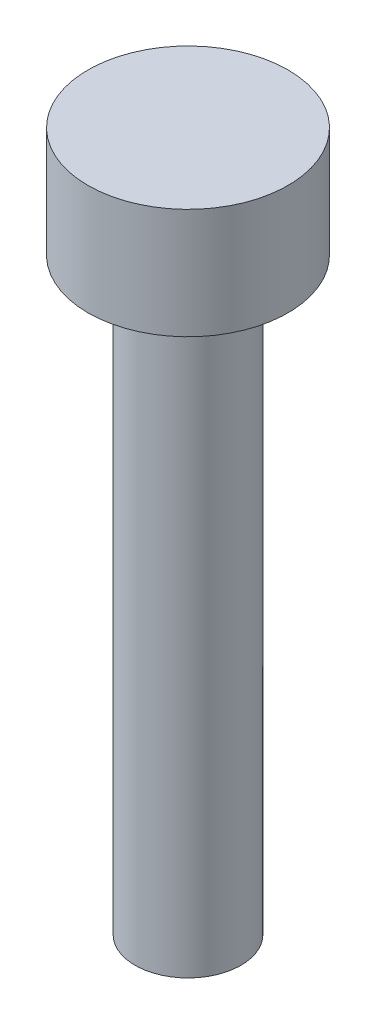
ISO-10303-21;
HEADER;
FILE_DESCRIPTION(('STEP AP214'),'2;1');
FILE_NAME('part.step','',(''),(''),'','','');
FILE_SCHEMA(('AUTOMOTIVE_DESIGN { 1 0 10303 214 1 1 1 1 }'));
ENDSEC;
DATA;
#1=APPLICATION_CONTEXT('core data for automotive mechanical design processes');
#2=APPLICATION_PROTOCOL_DEFINITION('international standard','automotive_design',2000,#1);
#3=PRODUCT_CONTEXT('',#1,'mechanical');
#4=PRODUCT('Part','Part','',(#3));
#5=PRODUCT_RELATED_PRODUCT_CATEGORY('part','',(#4));
#6=PRODUCT_DEFINITION_FORMATION('','',#4);
#7=PRODUCT_DEFINITION_CONTEXT('part definition',#1,'design');
#8=PRODUCT_DEFINITION('design','',#6,#7);
#9=PRODUCT_DEFINITION_SHAPE('','',#8);
#10=(LENGTH_UNIT() NAMED_UNIT(*) SI_UNIT(.MILLI.,.METRE.));
#11=(NAMED_UNIT(*) PLANE_ANGLE_UNIT() SI_UNIT($,.RADIAN.));
#12=(NAMED_UNIT(*) SI_UNIT($,.STERADIAN.) SOLID_ANGLE_UNIT());
#13=UNCERTAINTY_MEASURE_WITH_UNIT(LENGTH_MEASURE(1.E-05),#10,'distance_accuracy_value','');
#14=(GEOMETRIC_REPRESENTATION_CONTEXT(3) GLOBAL_UNCERTAINTY_ASSIGNED_CONTEXT((#13)) GLOBAL_UNIT_ASSIGNED_CONTEXT((#10,
#11,#12)) REPRESENTATION_CONTEXT('',''));
#15=CARTESIAN_POINT('',(0.,0.,0.));
#16=DIRECTION('',(0.,0.,1.));
#17=DIRECTION('',(1.,0.,0.));
#18=AXIS2_PLACEMENT_3D('',#15,#16,#17);
#19=CARTESIAN_POINT('',(0.,3.,0.));
#20=DIRECTION('',(0.,-1.,0.));
#21=DIRECTION('',(0.,0.,-1.));
#22=AXIS2_PLACEMENT_3D('',#19,#20,#21);
#23=CYLINDRICAL_SURFACE('',#22,2.72);
#24=CARTESIAN_POINT('',(0.,3.,0.));
#25=DIRECTION('',(0.,1.,0.));
#26=DIRECTION('',(0.,0.,1.));
#27=AXIS2_PLACEMENT_3D('',#24,#25,#26);
#28=CIRCLE('',#27,2.72);
#29=CARTESIAN_POINT('',(0.,3.,2.72));
#30=VERTEX_POINT('',#29);
#31=EDGE_CURVE('E45',#30,#30,#28,.T.);
#32=ORIENTED_EDGE('',*,*,#31,.F.);
#33=EDGE_LOOP('',(#32));
#34=FACE_BOUND('',#33,.T.);
#35=CARTESIAN_POINT('',(0.,0.,0.));
#36=DIRECTION('',(0.,1.,0.));
#37=DIRECTION('',(0.,0.,1.));
#38=AXIS2_PLACEMENT_3D('',#35,#36,#37);
#39=CIRCLE('',#38,2.72);
#40=CARTESIAN_POINT('',(0.,0.,2.72));
#41=VERTEX_POINT('',#40);
#42=EDGE_CURVE('E40',#41,#41,#39,.T.);
#43=ORIENTED_EDGE('',*,*,#42,.T.);
#44=EDGE_LOOP('',(#43));
#45=FACE_BOUND('',#44,.T.);
#46=ADVANCED_FACE('F37',(#34,#45),#23,.T.);
#47=CARTESIAN_POINT('',(0.,3.,0.));
#48=DIRECTION('',(0.,1.,0.));
#49=DIRECTION('',(0.,0.,1.));
#50=AXIS2_PLACEMENT_3D('',#47,#48,#49);
#51=PLANE('',#50);
#52=ORIENTED_EDGE('',*,*,#31,.T.);
#53=EDGE_LOOP('',(#52));
#54=FACE_BOUND('',#53,.T.);
#55=ADVANCED_FACE('F65',(#54),#51,.T.);
#56=CARTESIAN_POINT('',(0.,0.,0.));
#57=DIRECTION('',(0.,1.,0.));
#58=DIRECTION('',(0.,0.,1.));
#59=AXIS2_PLACEMENT_3D('',#56,#57,#58);
#60=PLANE('',#59);
#61=CARTESIAN_POINT('',(0.,0.,0.));
#62=DIRECTION('',(0.,-1.,0.));
#63=DIRECTION('',(0.,0.,-1.));
#64=AXIS2_PLACEMENT_3D('',#61,#62,#63);
#65=CIRCLE('',#64,1.44);
#66=CARTESIAN_POINT('',(0.,0.,-1.44));
#67=VERTEX_POINT('',#66);
#68=EDGE_CURVE('E10',#67,#67,#65,.T.);
#69=ORIENTED_EDGE('',*,*,#68,.F.);
#70=EDGE_LOOP('',(#69));
#71=FACE_BOUND('',#70,.T.);
#72=ORIENTED_EDGE('',*,*,#42,.F.);
#73=EDGE_LOOP('',(#72));
#74=FACE_BOUND('',#73,.T.);
#75=ADVANCED_FACE('F62',(#71,#74),#60,.F.);
#76=CARTESIAN_POINT('',(0.,-16.,0.));
#77=DIRECTION('',(0.,1.,0.));
#78=DIRECTION('',(0.,0.,1.));
#79=AXIS2_PLACEMENT_3D('',#76,#77,#78);
#80=CYLINDRICAL_SURFACE('',#79,1.44);
#81=CARTESIAN_POINT('',(0.,-16.,0.));
#82=DIRECTION('',(0.,-1.,0.));
#83=DIRECTION('',(0.,0.,-1.));
#84=AXIS2_PLACEMENT_3D('',#81,#82,#83);
#85=CIRCLE('',#84,1.44);
#86=CARTESIAN_POINT('',(0.,-16.,-1.44));
#87=VERTEX_POINT('',#86);
#88=EDGE_CURVE('E52',#87,#87,#85,.T.);
#89=ORIENTED_EDGE('',*,*,#88,.F.);
#90=EDGE_LOOP('',(#89));
#91=FACE_BOUND('',#90,.T.);
#92=ORIENTED_EDGE('',*,*,#68,.T.);
#93=EDGE_LOOP('',(#92));
#94=FACE_BOUND('',#93,.T.);
#95=ADVANCED_FACE('F64',(#91,#94),#80,.T.);
#96=CARTESIAN_POINT('',(0.,-16.,0.));
#97=DIRECTION('',(0.,-1.,0.));
#98=DIRECTION('',(0.,0.,-1.));
#99=AXIS2_PLACEMENT_3D('',#96,#97,#98);
#100=PLANE('',#99);
#101=ORIENTED_EDGE('',*,*,#88,.T.);
#102=EDGE_LOOP('',(#101));
#103=FACE_BOUND('',#102,.T.);
#104=ADVANCED_FACE('F71',(#103),#100,.T.);
#105=CLOSED_SHELL('',(#46,#55,#75,#95,#104));
#106=MANIFOLD_SOLID_BREP('B2',#105);
#107=ADVANCED_BREP_SHAPE_REPRESENTATION('',(#18,#106),#14);
#108=SHAPE_DEFINITION_REPRESENTATION(#9,#107);
ENDSEC;
END-ISO-10303-21;
